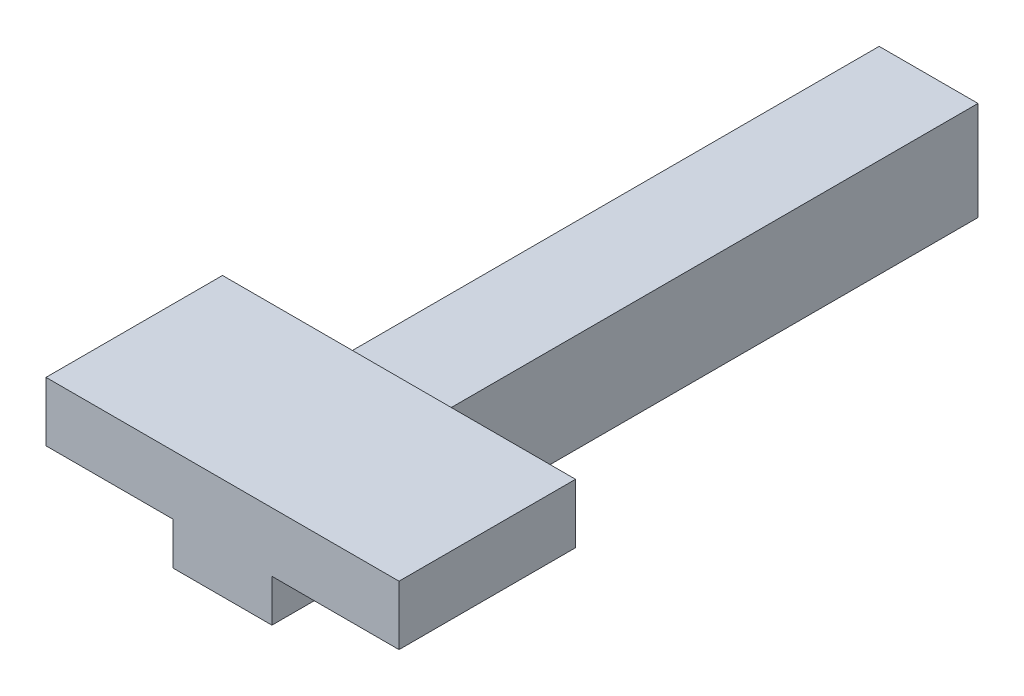
ISO-10303-21;
HEADER;
FILE_DESCRIPTION(('STEP AP214'),'2;1');
FILE_NAME('part.step','',(''),(''),'','','');
FILE_SCHEMA(('AUTOMOTIVE_DESIGN { 1 0 10303 214 1 1 1 1 }'));
ENDSEC;
DATA;
#1=APPLICATION_CONTEXT('core data for automotive mechanical design processes');
#2=APPLICATION_PROTOCOL_DEFINITION('international standard','automotive_design',2000,#1);
#3=PRODUCT_CONTEXT('',#1,'mechanical');
#4=PRODUCT('Part','Part','',(#3));
#5=PRODUCT_RELATED_PRODUCT_CATEGORY('part','',(#4));
#6=PRODUCT_DEFINITION_FORMATION('','',#4);
#7=PRODUCT_DEFINITION_CONTEXT('part definition',#1,'design');
#8=PRODUCT_DEFINITION('design','',#6,#7);
#9=PRODUCT_DEFINITION_SHAPE('','',#8);
#10=(LENGTH_UNIT() NAMED_UNIT(*) SI_UNIT(.MILLI.,.METRE.));
#11=(NAMED_UNIT(*) PLANE_ANGLE_UNIT() SI_UNIT($,.RADIAN.));
#12=(NAMED_UNIT(*) SI_UNIT($,.STERADIAN.) SOLID_ANGLE_UNIT());
#13=UNCERTAINTY_MEASURE_WITH_UNIT(LENGTH_MEASURE(1.E-05),#10,'distance_accuracy_value','');
#14=(GEOMETRIC_REPRESENTATION_CONTEXT(3) GLOBAL_UNCERTAINTY_ASSIGNED_CONTEXT((#13)) GLOBAL_UNIT_ASSIGNED_CONTEXT((#10,
#11,#12)) REPRESENTATION_CONTEXT('',''));
#15=CARTESIAN_POINT('',(0.,0.,0.));
#16=DIRECTION('',(0.,0.,1.));
#17=DIRECTION('',(1.,0.,0.));
#18=AXIS2_PLACEMENT_3D('',#15,#16,#17);
#19=CARTESIAN_POINT('',(-35.,35.,500.));
#20=DIRECTION('',(1.,0.,0.));
#21=DIRECTION('',(0.,1.,0.));
#22=AXIS2_PLACEMENT_3D('',#19,#20,#21);
#23=PLANE('',#22);
#24=DIRECTION('',(0.,-1.,0.));
#25=VECTOR('',#24,1.);
#26=CARTESIAN_POINT('',(-35.,35.,375.));
#27=LINE('',#26,#25);
#28=CARTESIAN_POINT('',(-35.,35.,375.));
#29=VERTEX_POINT('',#28);
#30=CARTESIAN_POINT('',(-35.,-5.,375.));
#31=VERTEX_POINT('',#30);
#32=EDGE_CURVE('E85',#29,#31,#27,.T.);
#33=ORIENTED_EDGE('',*,*,#32,.F.);
#34=DIRECTION('',(0.,0.,-1.));
#35=VECTOR('',#34,1.);
#36=CARTESIAN_POINT('',(-35.,35.,500.));
#37=LINE('',#36,#35);
#38=CARTESIAN_POINT('',(-35.,35.,0.));
#39=VERTEX_POINT('',#38);
#40=EDGE_CURVE('E79',#29,#39,#37,.T.);
#41=ORIENTED_EDGE('',*,*,#40,.T.);
#42=DIRECTION('',(0.,-1.,0.));
#43=VECTOR('',#42,1.);
#44=CARTESIAN_POINT('',(-35.,35.,0.));
#45=LINE('',#44,#43);
#46=CARTESIAN_POINT('',(-35.,-35.,0.));
#47=VERTEX_POINT('',#46);
#48=EDGE_CURVE('E82',#39,#47,#45,.T.);
#49=ORIENTED_EDGE('',*,*,#48,.T.);
#50=DIRECTION('',(0.,0.,-1.));
#51=VECTOR('',#50,1.);
#52=CARTESIAN_POINT('',(-35.,-35.,500.));
#53=LINE('',#52,#51);
#54=CARTESIAN_POINT('',(-35.,-35.,500.));
#55=VERTEX_POINT('',#54);
#56=EDGE_CURVE('E47',#55,#47,#53,.T.);
#57=ORIENTED_EDGE('',*,*,#56,.F.);
#58=DIRECTION('',(0.,-1.,0.));
#59=VECTOR('',#58,1.);
#60=CARTESIAN_POINT('',(-35.,35.,500.));
#61=LINE('',#60,#59);
#62=CARTESIAN_POINT('',(-35.,-5.,500.));
#63=VERTEX_POINT('',#62);
#64=EDGE_CURVE('E93',#63,#55,#61,.T.);
#65=ORIENTED_EDGE('',*,*,#64,.F.);
#66=DIRECTION('',(0.,0.,-1.));
#67=VECTOR('',#66,1.);
#68=CARTESIAN_POINT('',(-35.,-5.,500.));
#69=LINE('',#68,#67);
#70=EDGE_CURVE('E116',#63,#31,#69,.T.);
#71=ORIENTED_EDGE('',*,*,#70,.T.);
#72=EDGE_LOOP('',(#33,#41,#49,#57,#65,#71));
#73=FACE_BOUND('',#72,.T.);
#74=ADVANCED_FACE('F39',(#73),#23,.F.);
#75=CARTESIAN_POINT('',(35.,35.,500.));
#76=DIRECTION('',(-1.,0.,0.));
#77=DIRECTION('',(0.,-1.,0.));
#78=AXIS2_PLACEMENT_3D('',#75,#76,#77);
#79=PLANE('',#78);
#80=DIRECTION('',(0.,1.,0.));
#81=VECTOR('',#80,1.);
#82=CARTESIAN_POINT('',(35.,35.,375.));
#83=LINE('',#82,#81);
#84=CARTESIAN_POINT('',(35.,-4.99999999999999,375.));
#85=VERTEX_POINT('',#84);
#86=CARTESIAN_POINT('',(35.,35.,375.));
#87=VERTEX_POINT('',#86);
#88=EDGE_CURVE('E101',#85,#87,#83,.T.);
#89=ORIENTED_EDGE('',*,*,#88,.F.);
#90=DIRECTION('',(0.,0.,1.));
#91=VECTOR('',#90,1.);
#92=CARTESIAN_POINT('',(35.,-4.99999999999999,500.));
#93=LINE('',#92,#91);
#94=CARTESIAN_POINT('',(35.,-4.99999999999999,500.));
#95=VERTEX_POINT('',#94);
#96=EDGE_CURVE('E126',#85,#95,#93,.T.);
#97=ORIENTED_EDGE('',*,*,#96,.T.);
#98=DIRECTION('',(0.,1.,0.));
#99=VECTOR('',#98,1.);
#100=CARTESIAN_POINT('',(35.,35.,500.));
#101=LINE('',#100,#99);
#102=CARTESIAN_POINT('',(35.,-35.,500.));
#103=VERTEX_POINT('',#102);
#104=EDGE_CURVE('E86',#103,#95,#101,.T.);
#105=ORIENTED_EDGE('',*,*,#104,.F.);
#106=DIRECTION('',(0.,0.,-1.));
#107=VECTOR('',#106,1.);
#108=CARTESIAN_POINT('',(35.,-35.,500.));
#109=LINE('',#108,#107);
#110=CARTESIAN_POINT('',(35.,-35.,0.));
#111=VERTEX_POINT('',#110);
#112=EDGE_CURVE('E108',#103,#111,#109,.T.);
#113=ORIENTED_EDGE('',*,*,#112,.T.);
#114=DIRECTION('',(0.,1.,0.));
#115=VECTOR('',#114,1.);
#116=CARTESIAN_POINT('',(35.,35.,0.));
#117=LINE('',#116,#115);
#118=CARTESIAN_POINT('',(35.,35.,0.));
#119=VERTEX_POINT('',#118);
#120=EDGE_CURVE('E94',#111,#119,#117,.T.);
#121=ORIENTED_EDGE('',*,*,#120,.T.);
#122=DIRECTION('',(0.,0.,-1.));
#123=VECTOR('',#122,1.);
#124=CARTESIAN_POINT('',(35.,35.,500.));
#125=LINE('',#124,#123);
#126=EDGE_CURVE('E72',#87,#119,#125,.T.);
#127=ORIENTED_EDGE('',*,*,#126,.F.);
#128=EDGE_LOOP('',(#89,#97,#105,#113,#121,#127));
#129=FACE_BOUND('',#128,.T.);
#130=ADVANCED_FACE('F209',(#129),#79,.F.);
#131=CARTESIAN_POINT('',(35.,35.,500.));
#132=DIRECTION('',(0.,-1.,0.));
#133=DIRECTION('',(1.,0.,0.));
#134=AXIS2_PLACEMENT_3D('',#131,#132,#133);
#135=PLANE('',#134);
#136=DIRECTION('',(-1.,0.,0.));
#137=VECTOR('',#136,1.);
#138=CARTESIAN_POINT('',(35.,35.,375.));
#139=LINE('',#138,#137);
#140=EDGE_CURVE('E11',#87,#29,#139,.T.);
#141=ORIENTED_EDGE('',*,*,#140,.F.);
#142=ORIENTED_EDGE('',*,*,#126,.T.);
#143=DIRECTION('',(-1.,0.,0.));
#144=VECTOR('',#143,1.);
#145=CARTESIAN_POINT('',(35.,35.,0.));
#146=LINE('',#145,#144);
#147=EDGE_CURVE('E89',#119,#39,#146,.T.);
#148=ORIENTED_EDGE('',*,*,#147,.T.);
#149=ORIENTED_EDGE('',*,*,#40,.F.);
#150=EDGE_LOOP('',(#141,#142,#148,#149));
#151=FACE_BOUND('',#150,.T.);
#152=ADVANCED_FACE('F90',(#151),#135,.F.);
#153=CARTESIAN_POINT('',(35.,-35.,500.));
#154=DIRECTION('',(0.,1.,0.));
#155=DIRECTION('',(0.,0.,1.));
#156=AXIS2_PLACEMENT_3D('',#153,#154,#155);
#157=PLANE('',#156);
#158=DIRECTION('',(1.,0.,0.));
#159=VECTOR('',#158,1.);
#160=CARTESIAN_POINT('',(35.,-35.,0.));
#161=LINE('',#160,#159);
#162=EDGE_CURVE('E97',#47,#111,#161,.T.);
#163=ORIENTED_EDGE('',*,*,#162,.T.);
#164=ORIENTED_EDGE('',*,*,#112,.F.);
#165=DIRECTION('',(1.,0.,0.));
#166=VECTOR('',#165,1.);
#167=CARTESIAN_POINT('',(35.,-35.,500.));
#168=LINE('',#167,#166);
#169=EDGE_CURVE('E55',#55,#103,#168,.T.);
#170=ORIENTED_EDGE('',*,*,#169,.F.);
#171=ORIENTED_EDGE('',*,*,#56,.T.);
#172=EDGE_LOOP('',(#163,#164,#170,#171));
#173=FACE_BOUND('',#172,.T.);
#174=ADVANCED_FACE('F111',(#173),#157,.F.);
#175=CARTESIAN_POINT('',(0.,0.,500.));
#176=DIRECTION('',(0.,0.,-1.));
#177=DIRECTION('',(-1.,0.,0.));
#178=AXIS2_PLACEMENT_3D('',#175,#176,#177);
#179=PLANE('',#178);
#180=DIRECTION('',(1.,0.,0.));
#181=VECTOR('',#180,1.);
#182=CARTESIAN_POINT('',(-125.,-5.00000000000001,500.));
#183=LINE('',#182,#181);
#184=CARTESIAN_POINT('',(-125.,-5.00000000000001,500.));
#185=VERTEX_POINT('',#184);
#186=EDGE_CURVE('E153',#185,#63,#183,.T.);
#187=ORIENTED_EDGE('',*,*,#186,.T.);
#188=ORIENTED_EDGE('',*,*,#64,.T.);
#189=ORIENTED_EDGE('',*,*,#169,.T.);
#190=ORIENTED_EDGE('',*,*,#104,.T.);
#191=CARTESIAN_POINT('',(125.,-4.99999999999998,500.));
#192=VERTEX_POINT('',#191);
#193=EDGE_CURVE('E155',#95,#192,#183,.T.);
#194=ORIENTED_EDGE('',*,*,#193,.T.);
#195=DIRECTION('',(0.,-1.,0.));
#196=VECTOR('',#195,1.);
#197=CARTESIAN_POINT('',(125.,37.,500.));
#198=LINE('',#197,#196);
#199=CARTESIAN_POINT('',(125.,37.,500.));
#200=VERTEX_POINT('',#199);
#201=EDGE_CURVE('E138',#200,#192,#198,.T.);
#202=ORIENTED_EDGE('',*,*,#201,.F.);
#203=DIRECTION('',(1.,0.,0.));
#204=VECTOR('',#203,1.);
#205=CARTESIAN_POINT('',(-125.,37.,500.));
#206=LINE('',#205,#204);
#207=CARTESIAN_POINT('',(-125.,37.,500.));
#208=VERTEX_POINT('',#207);
#209=EDGE_CURVE('E141',#208,#200,#206,.T.);
#210=ORIENTED_EDGE('',*,*,#209,.F.);
#211=DIRECTION('',(0.,-1.,0.));
#212=VECTOR('',#211,1.);
#213=CARTESIAN_POINT('',(-125.,37.,500.));
#214=LINE('',#213,#212);
#215=EDGE_CURVE('E135',#208,#185,#214,.T.);
#216=ORIENTED_EDGE('',*,*,#215,.T.);
#217=EDGE_LOOP('',(#187,#188,#189,#190,#194,#202,#210,#216));
#218=FACE_BOUND('',#217,.T.);
#219=ADVANCED_FACE('F189',(#218),#179,.F.);
#220=CARTESIAN_POINT('',(0.,0.,0.));
#221=DIRECTION('',(0.,0.,-1.));
#222=DIRECTION('',(-1.,0.,0.));
#223=AXIS2_PLACEMENT_3D('',#220,#221,#222);
#224=PLANE('',#223);
#225=ORIENTED_EDGE('',*,*,#48,.F.);
#226=ORIENTED_EDGE('',*,*,#147,.F.);
#227=ORIENTED_EDGE('',*,*,#120,.F.);
#228=ORIENTED_EDGE('',*,*,#162,.F.);
#229=EDGE_LOOP('',(#225,#226,#227,#228));
#230=FACE_BOUND('',#229,.T.);
#231=ADVANCED_FACE('F96',(#230),#224,.T.);
#232=CARTESIAN_POINT('',(-125.,37.,375.));
#233=DIRECTION('',(0.,0.,1.));
#234=DIRECTION('',(1.,0.,0.));
#235=AXIS2_PLACEMENT_3D('',#232,#233,#234);
#236=PLANE('',#235);
#237=ORIENTED_EDGE('',*,*,#140,.T.);
#238=ORIENTED_EDGE('',*,*,#32,.T.);
#239=DIRECTION('',(-1.,0.,0.));
#240=VECTOR('',#239,1.);
#241=CARTESIAN_POINT('',(-125.,-5.00000000000001,375.));
#242=LINE('',#241,#240);
#243=CARTESIAN_POINT('',(-125.,-5.00000000000001,375.));
#244=VERTEX_POINT('',#243);
#245=EDGE_CURVE('E162',#31,#244,#242,.T.);
#246=ORIENTED_EDGE('',*,*,#245,.T.);
#247=DIRECTION('',(0.,-1.,0.));
#248=VECTOR('',#247,1.);
#249=CARTESIAN_POINT('',(-125.,37.,375.));
#250=LINE('',#249,#248);
#251=CARTESIAN_POINT('',(-125.,37.,375.));
#252=VERTEX_POINT('',#251);
#253=EDGE_CURVE('E132',#252,#244,#250,.T.);
#254=ORIENTED_EDGE('',*,*,#253,.F.);
#255=DIRECTION('',(-1.,0.,0.));
#256=VECTOR('',#255,1.);
#257=CARTESIAN_POINT('',(-125.,37.,375.));
#258=LINE('',#257,#256);
#259=CARTESIAN_POINT('',(125.,37.,375.));
#260=VERTEX_POINT('',#259);
#261=EDGE_CURVE('E147',#260,#252,#258,.T.);
#262=ORIENTED_EDGE('',*,*,#261,.F.);
#263=DIRECTION('',(0.,-1.,0.));
#264=VECTOR('',#263,1.);
#265=CARTESIAN_POINT('',(125.,37.,375.));
#266=LINE('',#265,#264);
#267=CARTESIAN_POINT('',(125.,-4.99999999999998,375.));
#268=VERTEX_POINT('',#267);
#269=EDGE_CURVE('E129',#260,#268,#266,.T.);
#270=ORIENTED_EDGE('',*,*,#269,.T.);
#271=EDGE_CURVE('E159',#268,#85,#242,.T.);
#272=ORIENTED_EDGE('',*,*,#271,.T.);
#273=ORIENTED_EDGE('',*,*,#88,.T.);
#274=EDGE_LOOP('',(#237,#238,#246,#254,#262,#270,#272,#273));
#275=FACE_BOUND('',#274,.T.);
#276=ADVANCED_FACE('F174',(#275),#236,.F.);
#277=CARTESIAN_POINT('',(0.,-5.,0.));
#278=DIRECTION('',(0.,-1.,0.));
#279=DIRECTION('',(1.,0.,0.));
#280=AXIS2_PLACEMENT_3D('',#277,#278,#279);
#281=PLANE('',#280);
#282=ORIENTED_EDGE('',*,*,#70,.F.);
#283=ORIENTED_EDGE('',*,*,#186,.F.);
#284=DIRECTION('',(0.,0.,1.));
#285=VECTOR('',#284,1.);
#286=CARTESIAN_POINT('',(-125.,-5.00000000000001,500.));
#287=LINE('',#286,#285);
#288=EDGE_CURVE('E156',#244,#185,#287,.T.);
#289=ORIENTED_EDGE('',*,*,#288,.F.);
#290=ORIENTED_EDGE('',*,*,#245,.F.);
#291=EDGE_LOOP('',(#282,#283,#289,#290));
#292=FACE_BOUND('',#291,.T.);
#293=ADVANCED_FACE('F186',(#292),#281,.T.);
#294=ORIENTED_EDGE('',*,*,#96,.F.);
#295=ORIENTED_EDGE('',*,*,#271,.F.);
#296=DIRECTION('',(0.,0.,-1.));
#297=VECTOR('',#296,1.);
#298=CARTESIAN_POINT('',(125.,-4.99999999999998,500.));
#299=LINE('',#298,#297);
#300=EDGE_CURVE('E163',#192,#268,#299,.T.);
#301=ORIENTED_EDGE('',*,*,#300,.F.);
#302=ORIENTED_EDGE('',*,*,#193,.F.);
#303=EDGE_LOOP('',(#294,#295,#301,#302));
#304=FACE_BOUND('',#303,.T.);
#305=ADVANCED_FACE('F217',(#304),#281,.T.);
#306=CARTESIAN_POINT('',(125.,37.,500.));
#307=DIRECTION('',(-1.,0.,0.));
#308=DIRECTION('',(0.,-1.,0.));
#309=AXIS2_PLACEMENT_3D('',#306,#307,#308);
#310=PLANE('',#309);
#311=ORIENTED_EDGE('',*,*,#201,.T.);
#312=ORIENTED_EDGE('',*,*,#300,.T.);
#313=ORIENTED_EDGE('',*,*,#269,.F.);
#314=DIRECTION('',(0.,0.,-1.));
#315=VECTOR('',#314,1.);
#316=CARTESIAN_POINT('',(125.,37.,500.));
#317=LINE('',#316,#315);
#318=EDGE_CURVE('E150',#200,#260,#317,.T.);
#319=ORIENTED_EDGE('',*,*,#318,.F.);
#320=EDGE_LOOP('',(#311,#312,#313,#319));
#321=FACE_BOUND('',#320,.T.);
#322=ADVANCED_FACE('F215',(#321),#310,.F.);
#323=CARTESIAN_POINT('',(-125.,37.,500.));
#324=DIRECTION('',(1.,0.,0.));
#325=DIRECTION('',(0.,1.,0.));
#326=AXIS2_PLACEMENT_3D('',#323,#324,#325);
#327=PLANE('',#326);
#328=ORIENTED_EDGE('',*,*,#253,.T.);
#329=ORIENTED_EDGE('',*,*,#288,.T.);
#330=ORIENTED_EDGE('',*,*,#215,.F.);
#331=DIRECTION('',(0.,0.,1.));
#332=VECTOR('',#331,1.);
#333=CARTESIAN_POINT('',(-125.,37.,500.));
#334=LINE('',#333,#332);
#335=EDGE_CURVE('E144',#252,#208,#334,.T.);
#336=ORIENTED_EDGE('',*,*,#335,.F.);
#337=EDGE_LOOP('',(#328,#329,#330,#336));
#338=FACE_BOUND('',#337,.T.);
#339=ADVANCED_FACE('F183',(#338),#327,.F.);
#340=CARTESIAN_POINT('',(0.,37.,0.));
#341=DIRECTION('',(0.,-1.,0.));
#342=DIRECTION('',(1.,0.,0.));
#343=AXIS2_PLACEMENT_3D('',#340,#341,#342);
#344=PLANE('',#343);
#345=ORIENTED_EDGE('',*,*,#318,.T.);
#346=ORIENTED_EDGE('',*,*,#261,.T.);
#347=ORIENTED_EDGE('',*,*,#335,.T.);
#348=ORIENTED_EDGE('',*,*,#209,.T.);
#349=EDGE_LOOP('',(#345,#346,#347,#348));
#350=FACE_BOUND('',#349,.T.);
#351=ADVANCED_FACE('F219',(#350),#344,.F.);
#352=CLOSED_SHELL('',(#74,#130,#152,#174,#219,#231,#276,#293,#305,#322,#339,#351));
#353=MANIFOLD_SOLID_BREP('B2',#352);
#354=ADVANCED_BREP_SHAPE_REPRESENTATION('',(#18,#353),#14);
#355=SHAPE_DEFINITION_REPRESENTATION(#9,#354);
ENDSEC;
END-ISO-10303-21;
